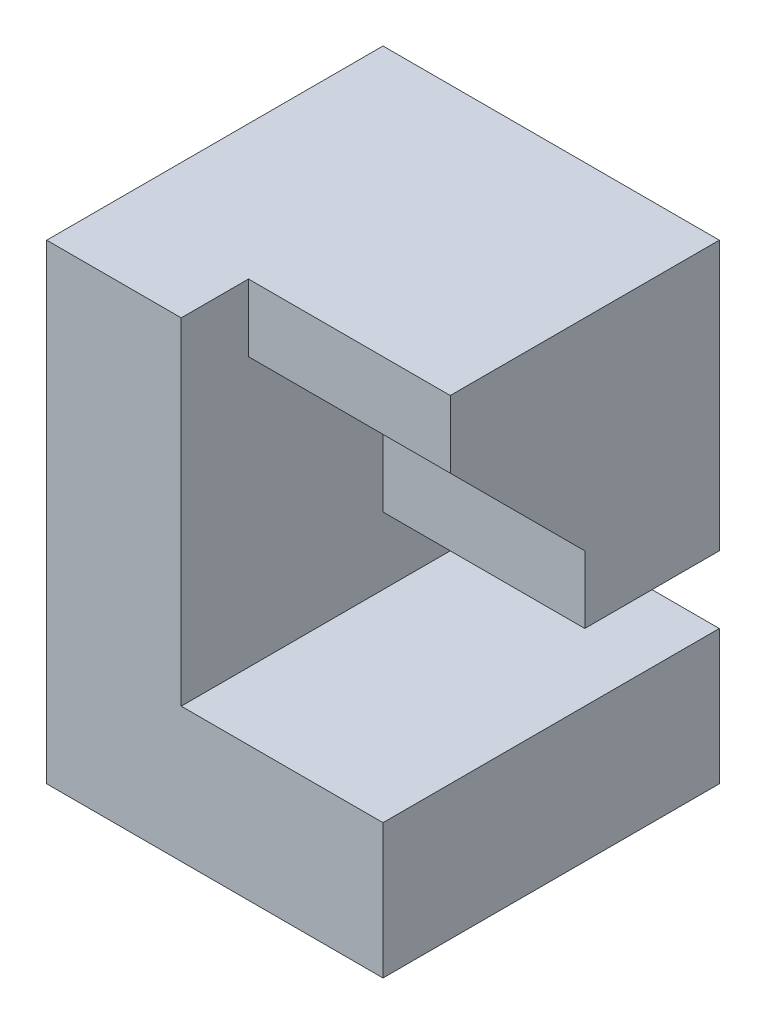
ISO-10303-21;
HEADER;
FILE_DESCRIPTION(('STEP AP214'),'2;1');
FILE_NAME('part.step','',(''),(''),'','','');
FILE_SCHEMA(('AUTOMOTIVE_DESIGN { 1 0 10303 214 1 1 1 1 }'));
ENDSEC;
DATA;
#1=APPLICATION_CONTEXT('core data for automotive mechanical design processes');
#2=APPLICATION_PROTOCOL_DEFINITION('international standard','automotive_design',2000,#1);
#3=PRODUCT_CONTEXT('',#1,'mechanical');
#4=PRODUCT('Part','Part','',(#3));
#5=PRODUCT_RELATED_PRODUCT_CATEGORY('part','',(#4));
#6=PRODUCT_DEFINITION_FORMATION('','',#4);
#7=PRODUCT_DEFINITION_CONTEXT('part definition',#1,'design');
#8=PRODUCT_DEFINITION('design','',#6,#7);
#9=PRODUCT_DEFINITION_SHAPE('','',#8);
#10=(LENGTH_UNIT() NAMED_UNIT(*) SI_UNIT(.MILLI.,.METRE.));
#11=(NAMED_UNIT(*) PLANE_ANGLE_UNIT() SI_UNIT($,.RADIAN.));
#12=(NAMED_UNIT(*) SI_UNIT($,.STERADIAN.) SOLID_ANGLE_UNIT());
#13=UNCERTAINTY_MEASURE_WITH_UNIT(LENGTH_MEASURE(1.E-05),#10,'distance_accuracy_value','');
#14=(GEOMETRIC_REPRESENTATION_CONTEXT(3) GLOBAL_UNCERTAINTY_ASSIGNED_CONTEXT((#13)) GLOBAL_UNIT_ASSIGNED_CONTEXT((#10,
#11,#12)) REPRESENTATION_CONTEXT('',''));
#15=CARTESIAN_POINT('',(0.,0.,0.));
#16=DIRECTION('',(0.,0.,1.));
#17=DIRECTION('',(1.,0.,0.));
#18=AXIS2_PLACEMENT_3D('',#15,#16,#17);
#19=CARTESIAN_POINT('',(5.,0.,0.));
#20=DIRECTION('',(1.,0.,0.));
#21=DIRECTION('',(0.,0.,-1.));
#22=AXIS2_PLACEMENT_3D('',#19,#20,#21);
#23=PLANE('',#22);
#24=DIRECTION('',(0.,0.,-1.));
#25=VECTOR('',#24,1.);
#26=CARTESIAN_POINT('',(5.,-1.5,-2.5));
#27=LINE('',#26,#25);
#28=CARTESIAN_POINT('',(5.,-1.5,2.5));
#29=VERTEX_POINT('',#28);
#30=CARTESIAN_POINT('',(5.,-1.5,-2.5));
#31=VERTEX_POINT('',#30);
#32=EDGE_CURVE('E144',#29,#31,#27,.T.);
#33=ORIENTED_EDGE('',*,*,#32,.F.);
#34=DIRECTION('',(0.,-1.,0.));
#35=VECTOR('',#34,1.);
#36=CARTESIAN_POINT('',(5.,-3.5,2.5));
#37=LINE('',#36,#35);
#38=CARTESIAN_POINT('',(5.,-3.5,2.5));
#39=VERTEX_POINT('',#38);
#40=EDGE_CURVE('E84',#29,#39,#37,.T.);
#41=ORIENTED_EDGE('',*,*,#40,.T.);
#42=DIRECTION('',(0.,0.,-1.));
#43=VECTOR('',#42,1.);
#44=CARTESIAN_POINT('',(5.,-3.5,-2.5));
#45=LINE('',#44,#43);
#46=CARTESIAN_POINT('',(5.,-3.5,-2.5));
#47=VERTEX_POINT('',#46);
#48=EDGE_CURVE('E155',#39,#47,#45,.T.);
#49=ORIENTED_EDGE('',*,*,#48,.T.);
#50=DIRECTION('',(0.,1.,0.));
#51=VECTOR('',#50,1.);
#52=CARTESIAN_POINT('',(5.,-3.5,-2.5));
#53=LINE('',#52,#51);
#54=EDGE_CURVE('E158',#47,#31,#53,.T.);
#55=ORIENTED_EDGE('',*,*,#54,.T.);
#56=EDGE_LOOP('',(#33,#41,#49,#55));
#57=FACE_BOUND('',#56,.T.);
#58=ADVANCED_FACE('F33',(#57),#23,.T.);
#59=CARTESIAN_POINT('',(5.,-3.5,2.5));
#60=DIRECTION('',(0.,0.,-1.));
#61=DIRECTION('',(-1.,0.,0.));
#62=AXIS2_PLACEMENT_3D('',#59,#60,#61);
#63=PLANE('',#62);
#64=ORIENTED_EDGE('',*,*,#40,.F.);
#65=DIRECTION('',(1.,0.,0.));
#66=VECTOR('',#65,1.);
#67=CARTESIAN_POINT('',(2.,-1.5,2.5));
#68=LINE('',#67,#66);
#69=CARTESIAN_POINT('',(2.,-1.5,2.5));
#70=VERTEX_POINT('',#69);
#71=EDGE_CURVE('E204',#70,#29,#68,.T.);
#72=ORIENTED_EDGE('',*,*,#71,.F.);
#73=DIRECTION('',(0.,-1.,0.));
#74=VECTOR('',#73,1.);
#75=CARTESIAN_POINT('',(2.,-1.5,2.5));
#76=LINE('',#75,#74);
#77=CARTESIAN_POINT('',(2.,3.5,2.5));
#78=VERTEX_POINT('',#77);
#79=EDGE_CURVE('E150',#78,#70,#76,.T.);
#80=ORIENTED_EDGE('',*,*,#79,.F.);
#81=DIRECTION('',(-1.,0.,0.));
#82=VECTOR('',#81,1.);
#83=CARTESIAN_POINT('',(5.,3.5,2.5));
#84=LINE('',#83,#82);
#85=CARTESIAN_POINT('',(0.,3.5,2.5));
#86=VERTEX_POINT('',#85);
#87=EDGE_CURVE('E78',#78,#86,#84,.T.);
#88=ORIENTED_EDGE('',*,*,#87,.T.);
#89=DIRECTION('',(0.,-1.,0.));
#90=VECTOR('',#89,1.);
#91=CARTESIAN_POINT('',(0.,-3.5,2.5));
#92=LINE('',#91,#90);
#93=CARTESIAN_POINT('',(0.,-3.5,2.5));
#94=VERTEX_POINT('',#93);
#95=EDGE_CURVE('E163',#86,#94,#92,.T.);
#96=ORIENTED_EDGE('',*,*,#95,.T.);
#97=DIRECTION('',(-1.,0.,0.));
#98=VECTOR('',#97,1.);
#99=CARTESIAN_POINT('',(5.,-3.5,2.5));
#100=LINE('',#99,#98);
#101=EDGE_CURVE('E11',#39,#94,#100,.T.);
#102=ORIENTED_EDGE('',*,*,#101,.F.);
#103=EDGE_LOOP('',(#64,#72,#80,#88,#96,#102));
#104=FACE_BOUND('',#103,.T.);
#105=ADVANCED_FACE('F35',(#104),#63,.F.);
#106=CARTESIAN_POINT('',(5.,-3.5,-2.5));
#107=DIRECTION('',(0.,1.,0.));
#108=DIRECTION('',(0.,0.,1.));
#109=AXIS2_PLACEMENT_3D('',#106,#107,#108);
#110=PLANE('',#109);
#111=DIRECTION('',(0.,0.,-1.));
#112=VECTOR('',#111,1.);
#113=CARTESIAN_POINT('',(0.,-3.5,-2.5));
#114=LINE('',#113,#112);
#115=CARTESIAN_POINT('',(0.,-3.5,-2.5));
#116=VERTEX_POINT('',#115);
#117=EDGE_CURVE('E165',#94,#116,#114,.T.);
#118=ORIENTED_EDGE('',*,*,#117,.T.);
#119=DIRECTION('',(-1.,0.,0.));
#120=VECTOR('',#119,1.);
#121=CARTESIAN_POINT('',(5.,-3.5,-2.5));
#122=LINE('',#121,#120);
#123=EDGE_CURVE('E41',#47,#116,#122,.T.);
#124=ORIENTED_EDGE('',*,*,#123,.F.);
#125=ORIENTED_EDGE('',*,*,#48,.F.);
#126=ORIENTED_EDGE('',*,*,#101,.T.);
#127=EDGE_LOOP('',(#118,#124,#125,#126));
#128=FACE_BOUND('',#127,.T.);
#129=ADVANCED_FACE('F243',(#128),#110,.F.);
#130=CARTESIAN_POINT('',(5.,-3.5,-2.5));
#131=DIRECTION('',(0.,0.,1.));
#132=DIRECTION('',(1.,0.,0.));
#133=AXIS2_PLACEMENT_3D('',#130,#131,#132);
#134=PLANE('',#133);
#135=DIRECTION('',(0.,1.,0.));
#136=VECTOR('',#135,1.);
#137=CARTESIAN_POINT('',(2.,-0.499999999999997,-2.5));
#138=LINE('',#137,#136);
#139=CARTESIAN_POINT('',(2.,-1.5,-2.5));
#140=VERTEX_POINT('',#139);
#141=CARTESIAN_POINT('',(2.,-0.499999999999997,-2.5));
#142=VERTEX_POINT('',#141);
#143=EDGE_CURVE('E135',#140,#142,#138,.T.);
#144=ORIENTED_EDGE('',*,*,#143,.F.);
#145=DIRECTION('',(1.,0.,0.));
#146=VECTOR('',#145,1.);
#147=CARTESIAN_POINT('',(2.,-1.5,-2.5));
#148=LINE('',#147,#146);
#149=EDGE_CURVE('E166',#140,#31,#148,.T.);
#150=ORIENTED_EDGE('',*,*,#149,.T.);
#151=ORIENTED_EDGE('',*,*,#54,.F.);
#152=ORIENTED_EDGE('',*,*,#123,.T.);
#153=DIRECTION('',(0.,1.,0.));
#154=VECTOR('',#153,1.);
#155=CARTESIAN_POINT('',(0.,-3.5,-2.5));
#156=LINE('',#155,#154);
#157=CARTESIAN_POINT('',(0.,3.5,-2.5));
#158=VERTEX_POINT('',#157);
#159=EDGE_CURVE('E168',#116,#158,#156,.T.);
#160=ORIENTED_EDGE('',*,*,#159,.T.);
#161=DIRECTION('',(-1.,0.,0.));
#162=VECTOR('',#161,1.);
#163=CARTESIAN_POINT('',(5.,3.5,-2.5));
#164=LINE('',#163,#162);
#165=CARTESIAN_POINT('',(5.,3.5,-2.5));
#166=VERTEX_POINT('',#165);
#167=EDGE_CURVE('E172',#166,#158,#164,.T.);
#168=ORIENTED_EDGE('',*,*,#167,.F.);
#169=CARTESIAN_POINT('',(5.,-0.499999999999997,-2.5));
#170=VERTEX_POINT('',#169);
#171=EDGE_CURVE('E56',#170,#166,#53,.T.);
#172=ORIENTED_EDGE('',*,*,#171,.F.);
#173=DIRECTION('',(1.,0.,0.));
#174=VECTOR('',#173,1.);
#175=CARTESIAN_POINT('',(2.,-0.499999999999997,-2.5));
#176=LINE('',#175,#174);
#177=EDGE_CURVE('E48',#142,#170,#176,.T.);
#178=ORIENTED_EDGE('',*,*,#177,.F.);
#179=EDGE_LOOP('',(#144,#150,#151,#152,#160,#168,#172,#178));
#180=FACE_BOUND('',#179,.T.);
#181=ADVANCED_FACE('F146',(#180),#134,.F.);
#182=CARTESIAN_POINT('',(5.,3.5,-2.5));
#183=DIRECTION('',(0.,-1.,0.));
#184=DIRECTION('',(0.,0.,-1.));
#185=AXIS2_PLACEMENT_3D('',#182,#183,#184);
#186=PLANE('',#185);
#187=DIRECTION('',(0.,0.,1.));
#188=VECTOR('',#187,1.);
#189=CARTESIAN_POINT('',(2.,3.5,2.5));
#190=LINE('',#189,#188);
#191=CARTESIAN_POINT('',(2.,3.5,1.5));
#192=VERTEX_POINT('',#191);
#193=EDGE_CURVE('E220',#192,#78,#190,.T.);
#194=ORIENTED_EDGE('',*,*,#193,.F.);
#195=DIRECTION('',(1.,0.,0.));
#196=VECTOR('',#195,1.);
#197=CARTESIAN_POINT('',(2.,3.5,1.5));
#198=LINE('',#197,#196);
#199=CARTESIAN_POINT('',(5.,3.5,1.5));
#200=VERTEX_POINT('',#199);
#201=EDGE_CURVE('E188',#192,#200,#198,.T.);
#202=ORIENTED_EDGE('',*,*,#201,.T.);
#203=DIRECTION('',(0.,0.,1.));
#204=VECTOR('',#203,1.);
#205=CARTESIAN_POINT('',(5.,3.5,-2.5));
#206=LINE('',#205,#204);
#207=EDGE_CURVE('E161',#166,#200,#206,.T.);
#208=ORIENTED_EDGE('',*,*,#207,.F.);
#209=ORIENTED_EDGE('',*,*,#167,.T.);
#210=DIRECTION('',(0.,0.,1.));
#211=VECTOR('',#210,1.);
#212=CARTESIAN_POINT('',(0.,3.5,-2.5));
#213=LINE('',#212,#211);
#214=EDGE_CURVE('E156',#158,#86,#213,.T.);
#215=ORIENTED_EDGE('',*,*,#214,.T.);
#216=ORIENTED_EDGE('',*,*,#87,.F.);
#217=EDGE_LOOP('',(#194,#202,#208,#209,#215,#216));
#218=FACE_BOUND('',#217,.T.);
#219=ADVANCED_FACE('F185',(#218),#186,.F.);
#220=DIRECTION('',(0.,1.,0.));
#221=VECTOR('',#220,1.);
#222=CARTESIAN_POINT('',(5.,3.5,1.5));
#223=LINE('',#222,#221);
#224=CARTESIAN_POINT('',(5.,2.5,1.5));
#225=VERTEX_POINT('',#224);
#226=EDGE_CURVE('E192',#225,#200,#223,.T.);
#227=ORIENTED_EDGE('',*,*,#226,.F.);
#228=DIRECTION('',(0.,0.707106781186548,0.707106781186548));
#229=VECTOR('',#228,1.);
#230=CARTESIAN_POINT('',(5.,2.5,1.5));
#231=LINE('',#230,#229);
#232=CARTESIAN_POINT('',(5.,0.500000000000002,-0.499999999999999));
#233=VERTEX_POINT('',#232);
#234=EDGE_CURVE('E195',#233,#225,#231,.T.);
#235=ORIENTED_EDGE('',*,*,#234,.F.);
#236=DIRECTION('',(0.,1.,0.));
#237=VECTOR('',#236,1.);
#238=CARTESIAN_POINT('',(5.,0.500000000000002,-0.499999999999999));
#239=LINE('',#238,#237);
#240=CARTESIAN_POINT('',(5.,-0.499999999999998,-0.5));
#241=VERTEX_POINT('',#240);
#242=EDGE_CURVE('E199',#241,#233,#239,.T.);
#243=ORIENTED_EDGE('',*,*,#242,.F.);
#244=DIRECTION('',(0.,0.,1.));
#245=VECTOR('',#244,1.);
#246=CARTESIAN_POINT('',(5.,-0.499999999999998,-0.5));
#247=LINE('',#246,#245);
#248=EDGE_CURVE('E216',#170,#241,#247,.T.);
#249=ORIENTED_EDGE('',*,*,#248,.F.);
#250=ORIENTED_EDGE('',*,*,#171,.T.);
#251=ORIENTED_EDGE('',*,*,#207,.T.);
#252=EDGE_LOOP('',(#227,#235,#243,#249,#250,#251));
#253=FACE_BOUND('',#252,.T.);
#254=ADVANCED_FACE('F190',(#253),#23,.T.);
#255=CARTESIAN_POINT('',(0.,0.,0.));
#256=DIRECTION('',(1.,0.,0.));
#257=DIRECTION('',(0.,0.,-1.));
#258=AXIS2_PLACEMENT_3D('',#255,#256,#257);
#259=PLANE('',#258);
#260=ORIENTED_EDGE('',*,*,#95,.F.);
#261=ORIENTED_EDGE('',*,*,#214,.F.);
#262=ORIENTED_EDGE('',*,*,#159,.F.);
#263=ORIENTED_EDGE('',*,*,#117,.F.);
#264=EDGE_LOOP('',(#260,#261,#262,#263));
#265=FACE_BOUND('',#264,.T.);
#266=ADVANCED_FACE('F182',(#265),#259,.F.);
#267=CARTESIAN_POINT('',(2.,-1.5,-2.5));
#268=DIRECTION('',(0.,-1.,0.));
#269=DIRECTION('',(0.,0.,-1.));
#270=AXIS2_PLACEMENT_3D('',#267,#268,#269);
#271=PLANE('',#270);
#272=ORIENTED_EDGE('',*,*,#32,.T.);
#273=ORIENTED_EDGE('',*,*,#149,.F.);
#274=DIRECTION('',(0.,0.,-1.));
#275=VECTOR('',#274,1.);
#276=CARTESIAN_POINT('',(2.,-1.5,-2.5));
#277=LINE('',#276,#275);
#278=EDGE_CURVE('E141',#70,#140,#277,.T.);
#279=ORIENTED_EDGE('',*,*,#278,.F.);
#280=ORIENTED_EDGE('',*,*,#71,.T.);
#281=EDGE_LOOP('',(#272,#273,#279,#280));
#282=FACE_BOUND('',#281,.T.);
#283=ADVANCED_FACE('F229',(#282),#271,.F.);
#284=CARTESIAN_POINT('',(2.,3.5,1.5));
#285=DIRECTION('',(0.,0.,-1.));
#286=DIRECTION('',(0.,1.,0.));
#287=AXIS2_PLACEMENT_3D('',#284,#285,#286);
#288=PLANE('',#287);
#289=ORIENTED_EDGE('',*,*,#226,.T.);
#290=ORIENTED_EDGE('',*,*,#201,.F.);
#291=DIRECTION('',(0.,1.,0.));
#292=VECTOR('',#291,1.);
#293=CARTESIAN_POINT('',(2.,3.5,1.5));
#294=LINE('',#293,#292);
#295=CARTESIAN_POINT('',(2.,2.5,1.5));
#296=VERTEX_POINT('',#295);
#297=EDGE_CURVE('E222',#296,#192,#294,.T.);
#298=ORIENTED_EDGE('',*,*,#297,.F.);
#299=DIRECTION('',(1.,0.,0.));
#300=VECTOR('',#299,1.);
#301=CARTESIAN_POINT('',(2.,2.5,1.5));
#302=LINE('',#301,#300);
#303=EDGE_CURVE('E207',#296,#225,#302,.T.);
#304=ORIENTED_EDGE('',*,*,#303,.T.);
#305=EDGE_LOOP('',(#289,#290,#298,#304));
#306=FACE_BOUND('',#305,.T.);
#307=ADVANCED_FACE('F227',(#306),#288,.F.);
#308=CARTESIAN_POINT('',(2.,2.5,1.5));
#309=DIRECTION('',(0.,0.707106781186547,-0.707106781186547));
#310=DIRECTION('',(0.,0.707106781186548,0.707106781186548));
#311=AXIS2_PLACEMENT_3D('',#308,#309,#310);
#312=PLANE('',#311);
#313=ORIENTED_EDGE('',*,*,#234,.T.);
#314=ORIENTED_EDGE('',*,*,#303,.F.);
#315=DIRECTION('',(0.,0.707106781186548,0.707106781186548));
#316=VECTOR('',#315,1.);
#317=CARTESIAN_POINT('',(2.,2.5,1.5));
#318=LINE('',#317,#316);
#319=CARTESIAN_POINT('',(2.,0.500000000000002,-0.499999999999999));
#320=VERTEX_POINT('',#319);
#321=EDGE_CURVE('E213',#320,#296,#318,.T.);
#322=ORIENTED_EDGE('',*,*,#321,.F.);
#323=DIRECTION('',(1.,0.,0.));
#324=VECTOR('',#323,1.);
#325=CARTESIAN_POINT('',(2.,0.500000000000002,-0.499999999999999));
#326=LINE('',#325,#324);
#327=EDGE_CURVE('E148',#320,#233,#326,.T.);
#328=ORIENTED_EDGE('',*,*,#327,.T.);
#329=EDGE_LOOP('',(#313,#314,#322,#328));
#330=FACE_BOUND('',#329,.T.);
#331=ADVANCED_FACE('F211',(#330),#312,.F.);
#332=CARTESIAN_POINT('',(2.,0.500000000000002,-0.499999999999999));
#333=DIRECTION('',(0.,0.,-1.));
#334=DIRECTION('',(0.,1.,0.));
#335=AXIS2_PLACEMENT_3D('',#332,#333,#334);
#336=PLANE('',#335);
#337=ORIENTED_EDGE('',*,*,#242,.T.);
#338=ORIENTED_EDGE('',*,*,#327,.F.);
#339=DIRECTION('',(0.,1.,0.));
#340=VECTOR('',#339,1.);
#341=CARTESIAN_POINT('',(2.,0.500000000000002,-0.499999999999999));
#342=LINE('',#341,#340);
#343=CARTESIAN_POINT('',(2.,-0.499999999999998,-0.5));
#344=VERTEX_POINT('',#343);
#345=EDGE_CURVE('E134',#344,#320,#342,.T.);
#346=ORIENTED_EDGE('',*,*,#345,.F.);
#347=DIRECTION('',(1.,0.,0.));
#348=VECTOR('',#347,1.);
#349=CARTESIAN_POINT('',(2.,-0.499999999999998,-0.5));
#350=LINE('',#349,#348);
#351=EDGE_CURVE('E130',#344,#241,#350,.T.);
#352=ORIENTED_EDGE('',*,*,#351,.T.);
#353=EDGE_LOOP('',(#337,#338,#346,#352));
#354=FACE_BOUND('',#353,.T.);
#355=ADVANCED_FACE('F215',(#354),#336,.F.);
#356=CARTESIAN_POINT('',(2.,-0.499999999999998,-0.5));
#357=DIRECTION('',(0.,1.,0.));
#358=DIRECTION('',(0.,0.,1.));
#359=AXIS2_PLACEMENT_3D('',#356,#357,#358);
#360=PLANE('',#359);
#361=ORIENTED_EDGE('',*,*,#248,.T.);
#362=ORIENTED_EDGE('',*,*,#351,.F.);
#363=DIRECTION('',(0.,0.,1.));
#364=VECTOR('',#363,1.);
#365=CARTESIAN_POINT('',(2.,-0.499999999999998,-0.5));
#366=LINE('',#365,#364);
#367=EDGE_CURVE('E127',#142,#344,#366,.T.);
#368=ORIENTED_EDGE('',*,*,#367,.F.);
#369=ORIENTED_EDGE('',*,*,#177,.T.);
#370=EDGE_LOOP('',(#361,#362,#368,#369));
#371=FACE_BOUND('',#370,.T.);
#372=ADVANCED_FACE('F129',(#371),#360,.F.);
#373=CARTESIAN_POINT('',(2.,0.,0.));
#374=DIRECTION('',(-1.,0.,0.));
#375=DIRECTION('',(0.,0.,1.));
#376=AXIS2_PLACEMENT_3D('',#373,#374,#375);
#377=PLANE('',#376);
#378=ORIENTED_EDGE('',*,*,#143,.T.);
#379=ORIENTED_EDGE('',*,*,#367,.T.);
#380=ORIENTED_EDGE('',*,*,#345,.T.);
#381=ORIENTED_EDGE('',*,*,#321,.T.);
#382=ORIENTED_EDGE('',*,*,#297,.T.);
#383=ORIENTED_EDGE('',*,*,#193,.T.);
#384=ORIENTED_EDGE('',*,*,#79,.T.);
#385=ORIENTED_EDGE('',*,*,#278,.T.);
#386=EDGE_LOOP('',(#378,#379,#380,#381,#382,#383,#384,#385));
#387=FACE_BOUND('',#386,.T.);
#388=ADVANCED_FACE('F139',(#387),#377,.F.);
#389=CLOSED_SHELL('',(#58,#105,#129,#181,#219,#254,#266,#283,#307,#331,#355,#372,#388));
#390=MANIFOLD_SOLID_BREP('B2',#389);
#391=ADVANCED_BREP_SHAPE_REPRESENTATION('',(#18,#390),#14);
#392=SHAPE_DEFINITION_REPRESENTATION(#9,#391);
ENDSEC;
END-ISO-10303-21;
